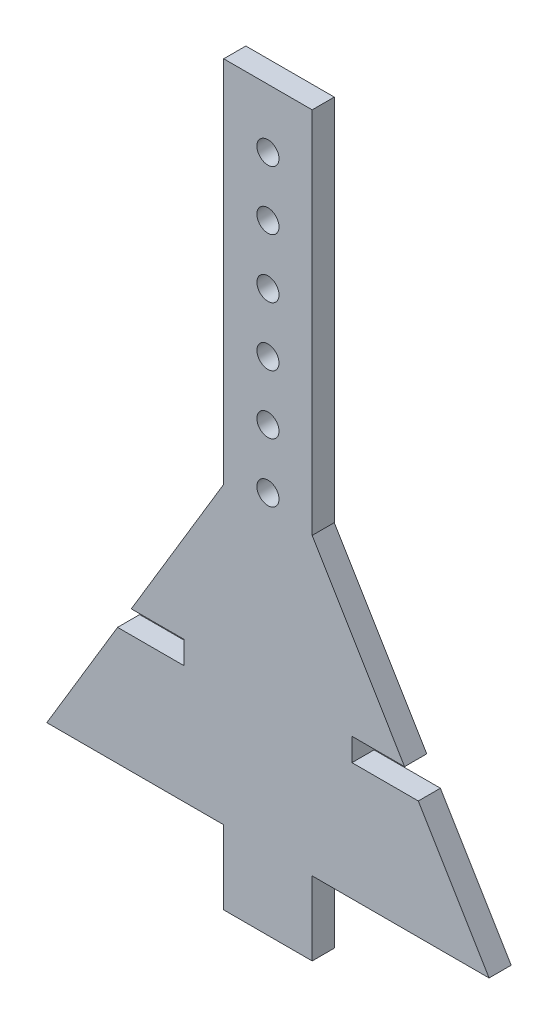
ISO-10303-21;
HEADER;
FILE_DESCRIPTION(('STEP AP214'),'2;1');
FILE_NAME('part.step','',(''),(''),'','','');
FILE_SCHEMA(('AUTOMOTIVE_DESIGN { 1 0 10303 214 1 1 1 1 }'));
ENDSEC;
DATA;
#1=APPLICATION_CONTEXT('core data for automotive mechanical design processes');
#2=APPLICATION_PROTOCOL_DEFINITION('international standard','automotive_design',2000,#1);
#3=PRODUCT_CONTEXT('',#1,'mechanical');
#4=PRODUCT('Part','Part','',(#3));
#5=PRODUCT_RELATED_PRODUCT_CATEGORY('part','',(#4));
#6=PRODUCT_DEFINITION_FORMATION('','',#4);
#7=PRODUCT_DEFINITION_CONTEXT('part definition',#1,'design');
#8=PRODUCT_DEFINITION('design','',#6,#7);
#9=PRODUCT_DEFINITION_SHAPE('','',#8);
#10=(LENGTH_UNIT() NAMED_UNIT(*) SI_UNIT(.MILLI.,.METRE.));
#11=(NAMED_UNIT(*) PLANE_ANGLE_UNIT() SI_UNIT($,.RADIAN.));
#12=(NAMED_UNIT(*) SI_UNIT($,.STERADIAN.) SOLID_ANGLE_UNIT());
#13=UNCERTAINTY_MEASURE_WITH_UNIT(LENGTH_MEASURE(1.E-05),#10,'distance_accuracy_value','');
#14=(GEOMETRIC_REPRESENTATION_CONTEXT(3) GLOBAL_UNCERTAINTY_ASSIGNED_CONTEXT((#13)) GLOBAL_UNIT_ASSIGNED_CONTEXT((#10,
#11,#12)) REPRESENTATION_CONTEXT('',''));
#15=CARTESIAN_POINT('',(0.,0.,0.));
#16=DIRECTION('',(0.,0.,1.));
#17=DIRECTION('',(1.,0.,0.));
#18=AXIS2_PLACEMENT_3D('',#15,#16,#17);
#19=CARTESIAN_POINT('',(0.,0.,15.));
#20=DIRECTION('',(0.,0.,1.));
#21=DIRECTION('',(1.,0.,0.));
#22=AXIS2_PLACEMENT_3D('',#19,#20,#21);
#23=PLANE('',#22);
#24=CARTESIAN_POINT('',(1.66533453693773E-12,50.,15.));
#25=DIRECTION('',(0.,0.,1.));
#26=DIRECTION('',(1.,0.,0.));
#27=AXIS2_PLACEMENT_3D('',#24,#25,#26);
#28=CIRCLE('',#27,7.5);
#29=CARTESIAN_POINT('',(7.50000000000167,50.,15.));
#30=VERTEX_POINT('',#29);
#31=EDGE_CURVE('E217',#30,#30,#28,.T.);
#32=ORIENTED_EDGE('',*,*,#31,.F.);
#33=EDGE_LOOP('',(#32));
#34=FACE_BOUND('',#33,.T.);
#35=CARTESIAN_POINT('',(8.88178419700125E-13,130.,15.));
#36=DIRECTION('',(0.,0.,1.));
#37=DIRECTION('',(1.,0.,0.));
#38=AXIS2_PLACEMENT_3D('',#35,#36,#37);
#39=CIRCLE('',#38,7.5);
#40=CARTESIAN_POINT('',(7.50000000000089,130.,15.));
#41=VERTEX_POINT('',#40);
#42=EDGE_CURVE('E229',#41,#41,#39,.T.);
#43=ORIENTED_EDGE('',*,*,#42,.F.);
#44=EDGE_LOOP('',(#43));
#45=FACE_BOUND('',#44,.T.);
#46=CARTESIAN_POINT('',(0.,210.,15.));
#47=DIRECTION('',(0.,0.,1.));
#48=DIRECTION('',(1.,0.,0.));
#49=AXIS2_PLACEMENT_3D('',#46,#47,#48);
#50=CIRCLE('',#49,7.5);
#51=CARTESIAN_POINT('',(7.5,210.,15.));
#52=VERTEX_POINT('',#51);
#53=EDGE_CURVE('E241',#52,#52,#50,.T.);
#54=ORIENTED_EDGE('',*,*,#53,.F.);
#55=EDGE_LOOP('',(#54));
#56=FACE_BOUND('',#55,.T.);
#57=CARTESIAN_POINT('',(4.44089209850063E-13,170.,15.));
#58=DIRECTION('',(0.,0.,1.));
#59=DIRECTION('',(1.,0.,0.));
#60=AXIS2_PLACEMENT_3D('',#57,#58,#59);
#61=CIRCLE('',#60,7.5);
#62=CARTESIAN_POINT('',(7.50000000000045,170.,15.));
#63=VERTEX_POINT('',#62);
#64=EDGE_CURVE('E235',#63,#63,#61,.T.);
#65=ORIENTED_EDGE('',*,*,#64,.F.);
#66=EDGE_LOOP('',(#65));
#67=FACE_BOUND('',#66,.T.);
#68=CARTESIAN_POINT('',(1.22124532708767E-12,90.,15.));
#69=DIRECTION('',(0.,0.,1.));
#70=DIRECTION('',(1.,0.,0.));
#71=AXIS2_PLACEMENT_3D('',#68,#69,#70);
#72=CIRCLE('',#71,7.5);
#73=CARTESIAN_POINT('',(7.50000000000122,90.,15.));
#74=VERTEX_POINT('',#73);
#75=EDGE_CURVE('E223',#74,#74,#72,.T.);
#76=ORIENTED_EDGE('',*,*,#75,.F.);
#77=EDGE_LOOP('',(#76));
#78=FACE_BOUND('',#77,.T.);
#79=CARTESIAN_POINT('',(2.1094237467878E-12,10.,15.));
#80=DIRECTION('',(0.,0.,1.));
#81=DIRECTION('',(1.,0.,0.));
#82=AXIS2_PLACEMENT_3D('',#79,#80,#81);
#83=CIRCLE('',#82,7.5);
#84=CARTESIAN_POINT('',(7.50000000000211,10.,15.));
#85=VERTEX_POINT('',#84);
#86=EDGE_CURVE('E211',#85,#85,#83,.T.);
#87=ORIENTED_EDGE('',*,*,#86,.F.);
#88=EDGE_LOOP('',(#87));
#89=FACE_BOUND('',#88,.T.);
#90=DIRECTION('',(-0.514495755427527,0.857492925712544,0.));
#91=VECTOR('',#90,1.);
#92=CARTESIAN_POINT('',(30.,0.,15.));
#93=LINE('',#92,#91);
#94=CARTESIAN_POINT('',(150.,-200.,15.));
#95=VERTEX_POINT('',#94);
#96=CARTESIAN_POINT('',(102.,-120.,15.));
#97=VERTEX_POINT('',#96);
#98=EDGE_CURVE('E266',#95,#97,#93,.T.);
#99=ORIENTED_EDGE('',*,*,#98,.T.);
#100=DIRECTION('',(-1.,0.,0.));
#101=VECTOR('',#100,1.);
#102=CARTESIAN_POINT('',(147.989913166257,-120.,15.));
#103=LINE('',#102,#101);
#104=CARTESIAN_POINT('',(57.,-120.,15.));
#105=VERTEX_POINT('',#104);
#106=EDGE_CURVE('E181',#97,#105,#103,.T.);
#107=ORIENTED_EDGE('',*,*,#106,.T.);
#108=DIRECTION('',(0.,1.,0.));
#109=VECTOR('',#108,1.);
#110=CARTESIAN_POINT('',(57.,-104.5,15.));
#111=LINE('',#110,#109);
#112=CARTESIAN_POINT('',(57.,-104.5,15.));
#113=VERTEX_POINT('',#112);
#114=EDGE_CURVE('E184',#105,#113,#111,.T.);
#115=ORIENTED_EDGE('',*,*,#114,.T.);
#116=DIRECTION('',(1.,0.,0.));
#117=VECTOR('',#116,1.);
#118=CARTESIAN_POINT('',(147.989913166257,-104.5,15.));
#119=LINE('',#118,#117);
#120=CARTESIAN_POINT('',(92.7,-104.5,15.));
#121=VERTEX_POINT('',#120);
#122=EDGE_CURVE('E174',#113,#121,#119,.T.);
#123=ORIENTED_EDGE('',*,*,#122,.T.);
#124=CARTESIAN_POINT('',(30.,0.,15.));
#125=VERTEX_POINT('',#124);
#126=EDGE_CURVE('E265',#121,#125,#93,.T.);
#127=ORIENTED_EDGE('',*,*,#126,.T.);
#128=DIRECTION('',(0.,1.,0.));
#129=VECTOR('',#128,1.);
#130=CARTESIAN_POINT('',(30.,0.,15.));
#131=LINE('',#130,#129);
#132=CARTESIAN_POINT('',(30.,250.,15.));
#133=VERTEX_POINT('',#132);
#134=EDGE_CURVE('E269',#125,#133,#131,.T.);
#135=ORIENTED_EDGE('',*,*,#134,.T.);
#136=DIRECTION('',(-1.,0.,0.));
#137=VECTOR('',#136,1.);
#138=CARTESIAN_POINT('',(30.,250.,15.));
#139=LINE('',#138,#137);
#140=CARTESIAN_POINT('',(-30.,250.,15.));
#141=VERTEX_POINT('',#140);
#142=EDGE_CURVE('E271',#133,#141,#139,.T.);
#143=ORIENTED_EDGE('',*,*,#142,.T.);
#144=DIRECTION('',(0.,-1.,0.));
#145=VECTOR('',#144,1.);
#146=CARTESIAN_POINT('',(-30.,0.,15.));
#147=LINE('',#146,#145);
#148=CARTESIAN_POINT('',(-30.,0.,15.));
#149=VERTEX_POINT('',#148);
#150=EDGE_CURVE('E247',#141,#149,#147,.T.);
#151=ORIENTED_EDGE('',*,*,#150,.T.);
#152=DIRECTION('',(-0.514495755427527,-0.857492925712544,0.));
#153=VECTOR('',#152,1.);
#154=CARTESIAN_POINT('',(-30.,0.,15.));
#155=LINE('',#154,#153);
#156=CARTESIAN_POINT('',(-92.7,-104.5,15.));
#157=VERTEX_POINT('',#156);
#158=EDGE_CURVE('E252',#149,#157,#155,.T.);
#159=ORIENTED_EDGE('',*,*,#158,.T.);
#160=DIRECTION('',(-1.,0.,0.));
#161=VECTOR('',#160,1.);
#162=CARTESIAN_POINT('',(-147.989913166257,-104.5,15.));
#163=LINE('',#162,#161);
#164=CARTESIAN_POINT('',(-57.,-104.5,15.));
#165=VERTEX_POINT('',#164);
#166=EDGE_CURVE('E194',#165,#157,#163,.T.);
#167=ORIENTED_EDGE('',*,*,#166,.F.);
#168=DIRECTION('',(0.,1.,0.));
#169=VECTOR('',#168,1.);
#170=CARTESIAN_POINT('',(-57.,-104.5,15.));
#171=LINE('',#170,#169);
#172=CARTESIAN_POINT('',(-57.,-120.,15.));
#173=VERTEX_POINT('',#172);
#174=EDGE_CURVE('E202',#173,#165,#171,.T.);
#175=ORIENTED_EDGE('',*,*,#174,.F.);
#176=DIRECTION('',(1.,0.,0.));
#177=VECTOR('',#176,1.);
#178=CARTESIAN_POINT('',(-147.989913166257,-120.,15.));
#179=LINE('',#178,#177);
#180=CARTESIAN_POINT('',(-102.,-120.,15.));
#181=VERTEX_POINT('',#180);
#182=EDGE_CURVE('E190',#181,#173,#179,.T.);
#183=ORIENTED_EDGE('',*,*,#182,.F.);
#184=CARTESIAN_POINT('',(-150.,-200.,15.));
#185=VERTEX_POINT('',#184);
#186=EDGE_CURVE('E250',#181,#185,#155,.T.);
#187=ORIENTED_EDGE('',*,*,#186,.T.);
#188=DIRECTION('',(1.,0.,0.));
#189=VECTOR('',#188,1.);
#190=CARTESIAN_POINT('',(-150.,-200.,15.));
#191=LINE('',#190,#189);
#192=CARTESIAN_POINT('',(-30.,-200.,15.));
#193=VERTEX_POINT('',#192);
#194=EDGE_CURVE('E255',#185,#193,#191,.T.);
#195=ORIENTED_EDGE('',*,*,#194,.T.);
#196=DIRECTION('',(0.,-1.,0.));
#197=VECTOR('',#196,1.);
#198=CARTESIAN_POINT('',(-30.,-250.,15.));
#199=LINE('',#198,#197);
#200=CARTESIAN_POINT('',(-30.,-250.,15.));
#201=VERTEX_POINT('',#200);
#202=EDGE_CURVE('E257',#193,#201,#199,.T.);
#203=ORIENTED_EDGE('',*,*,#202,.T.);
#204=DIRECTION('',(1.,0.,0.));
#205=VECTOR('',#204,1.);
#206=CARTESIAN_POINT('',(30.,-250.,15.));
#207=LINE('',#206,#205);
#208=CARTESIAN_POINT('',(30.,-250.,15.));
#209=VERTEX_POINT('',#208);
#210=EDGE_CURVE('E259',#201,#209,#207,.T.);
#211=ORIENTED_EDGE('',*,*,#210,.T.);
#212=DIRECTION('',(0.,1.,0.));
#213=VECTOR('',#212,1.);
#214=CARTESIAN_POINT('',(30.,-250.,15.));
#215=LINE('',#214,#213);
#216=CARTESIAN_POINT('',(30.,-200.,15.));
#217=VERTEX_POINT('',#216);
#218=EDGE_CURVE('E261',#209,#217,#215,.T.);
#219=ORIENTED_EDGE('',*,*,#218,.T.);
#220=DIRECTION('',(1.,0.,0.));
#221=VECTOR('',#220,1.);
#222=CARTESIAN_POINT('',(150.,-200.,15.));
#223=LINE('',#222,#221);
#224=EDGE_CURVE('E263',#217,#95,#223,.T.);
#225=ORIENTED_EDGE('',*,*,#224,.T.);
#226=EDGE_LOOP('',(#99,#107,#115,#123,#127,#135,#143,#151,#159,#167,#175,#183,#187,#195,#203,
#211,#219,#225));
#227=FACE_BOUND('',#226,.T.);
#228=ADVANCED_FACE('F37',(#34,#45,#56,#67,#78,#89,#227),#23,.T.);
#229=CARTESIAN_POINT('',(0.,0.,0.));
#230=DIRECTION('',(0.,0.,1.));
#231=DIRECTION('',(1.,0.,0.));
#232=AXIS2_PLACEMENT_3D('',#229,#230,#231);
#233=PLANE('',#232);
#234=CARTESIAN_POINT('',(2.1094237467878E-12,10.,0.));
#235=DIRECTION('',(0.,0.,1.));
#236=DIRECTION('',(1.,0.,0.));
#237=AXIS2_PLACEMENT_3D('',#234,#235,#236);
#238=CIRCLE('',#237,7.5);
#239=CARTESIAN_POINT('',(7.50000000000211,10.,0.));
#240=VERTEX_POINT('',#239);
#241=EDGE_CURVE('E208',#240,#240,#238,.T.);
#242=ORIENTED_EDGE('',*,*,#241,.T.);
#243=EDGE_LOOP('',(#242));
#244=FACE_BOUND('',#243,.T.);
#245=CARTESIAN_POINT('',(1.66533453693773E-12,50.,0.));
#246=DIRECTION('',(0.,0.,1.));
#247=DIRECTION('',(1.,0.,0.));
#248=AXIS2_PLACEMENT_3D('',#245,#246,#247);
#249=CIRCLE('',#248,7.5);
#250=CARTESIAN_POINT('',(7.50000000000167,50.,0.));
#251=VERTEX_POINT('',#250);
#252=EDGE_CURVE('E214',#251,#251,#249,.T.);
#253=ORIENTED_EDGE('',*,*,#252,.T.);
#254=EDGE_LOOP('',(#253));
#255=FACE_BOUND('',#254,.T.);
#256=CARTESIAN_POINT('',(1.22124532708767E-12,90.,0.));
#257=DIRECTION('',(0.,0.,1.));
#258=DIRECTION('',(1.,0.,0.));
#259=AXIS2_PLACEMENT_3D('',#256,#257,#258);
#260=CIRCLE('',#259,7.5);
#261=CARTESIAN_POINT('',(7.50000000000122,90.,0.));
#262=VERTEX_POINT('',#261);
#263=EDGE_CURVE('E220',#262,#262,#260,.T.);
#264=ORIENTED_EDGE('',*,*,#263,.T.);
#265=EDGE_LOOP('',(#264));
#266=FACE_BOUND('',#265,.T.);
#267=CARTESIAN_POINT('',(8.88178419700125E-13,130.,0.));
#268=DIRECTION('',(0.,0.,1.));
#269=DIRECTION('',(1.,0.,0.));
#270=AXIS2_PLACEMENT_3D('',#267,#268,#269);
#271=CIRCLE('',#270,7.5);
#272=CARTESIAN_POINT('',(7.50000000000089,130.,0.));
#273=VERTEX_POINT('',#272);
#274=EDGE_CURVE('E226',#273,#273,#271,.T.);
#275=ORIENTED_EDGE('',*,*,#274,.T.);
#276=EDGE_LOOP('',(#275));
#277=FACE_BOUND('',#276,.T.);
#278=CARTESIAN_POINT('',(4.44089209850063E-13,170.,0.));
#279=DIRECTION('',(0.,0.,1.));
#280=DIRECTION('',(1.,0.,0.));
#281=AXIS2_PLACEMENT_3D('',#278,#279,#280);
#282=CIRCLE('',#281,7.5);
#283=CARTESIAN_POINT('',(7.50000000000045,170.,0.));
#284=VERTEX_POINT('',#283);
#285=EDGE_CURVE('E232',#284,#284,#282,.T.);
#286=ORIENTED_EDGE('',*,*,#285,.T.);
#287=EDGE_LOOP('',(#286));
#288=FACE_BOUND('',#287,.T.);
#289=CARTESIAN_POINT('',(0.,210.,0.));
#290=DIRECTION('',(0.,0.,1.));
#291=DIRECTION('',(1.,0.,0.));
#292=AXIS2_PLACEMENT_3D('',#289,#290,#291);
#293=CIRCLE('',#292,7.5);
#294=CARTESIAN_POINT('',(7.5,210.,0.));
#295=VERTEX_POINT('',#294);
#296=EDGE_CURVE('E238',#295,#295,#293,.T.);
#297=ORIENTED_EDGE('',*,*,#296,.T.);
#298=EDGE_LOOP('',(#297));
#299=FACE_BOUND('',#298,.T.);
#300=DIRECTION('',(-1.,0.,0.));
#301=VECTOR('',#300,1.);
#302=CARTESIAN_POINT('',(147.989913166257,-120.,0.));
#303=LINE('',#302,#301);
#304=CARTESIAN_POINT('',(102.,-120.,0.));
#305=VERTEX_POINT('',#304);
#306=CARTESIAN_POINT('',(57.,-120.,0.));
#307=VERTEX_POINT('',#306);
#308=EDGE_CURVE('E170',#305,#307,#303,.T.);
#309=ORIENTED_EDGE('',*,*,#308,.F.);
#310=DIRECTION('',(-0.514495755427527,0.857492925712544,0.));
#311=VECTOR('',#310,1.);
#312=CARTESIAN_POINT('',(30.,0.,0.));
#313=LINE('',#312,#311);
#314=CARTESIAN_POINT('',(150.,-200.,0.));
#315=VERTEX_POINT('',#314);
#316=EDGE_CURVE('E290',#315,#305,#313,.T.);
#317=ORIENTED_EDGE('',*,*,#316,.F.);
#318=DIRECTION('',(1.,0.,0.));
#319=VECTOR('',#318,1.);
#320=CARTESIAN_POINT('',(150.,-200.,0.));
#321=LINE('',#320,#319);
#322=CARTESIAN_POINT('',(30.,-200.,0.));
#323=VERTEX_POINT('',#322);
#324=EDGE_CURVE('E288',#323,#315,#321,.T.);
#325=ORIENTED_EDGE('',*,*,#324,.F.);
#326=DIRECTION('',(0.,1.,0.));
#327=VECTOR('',#326,1.);
#328=CARTESIAN_POINT('',(30.,-250.,0.));
#329=LINE('',#328,#327);
#330=CARTESIAN_POINT('',(30.,-250.,0.));
#331=VERTEX_POINT('',#330);
#332=EDGE_CURVE('E286',#331,#323,#329,.T.);
#333=ORIENTED_EDGE('',*,*,#332,.F.);
#334=DIRECTION('',(1.,0.,0.));
#335=VECTOR('',#334,1.);
#336=CARTESIAN_POINT('',(30.,-250.,0.));
#337=LINE('',#336,#335);
#338=CARTESIAN_POINT('',(-30.,-250.,0.));
#339=VERTEX_POINT('',#338);
#340=EDGE_CURVE('E284',#339,#331,#337,.T.);
#341=ORIENTED_EDGE('',*,*,#340,.F.);
#342=DIRECTION('',(0.,-1.,0.));
#343=VECTOR('',#342,1.);
#344=CARTESIAN_POINT('',(-30.,-250.,0.));
#345=LINE('',#344,#343);
#346=CARTESIAN_POINT('',(-30.,-200.,0.));
#347=VERTEX_POINT('',#346);
#348=EDGE_CURVE('E282',#347,#339,#345,.T.);
#349=ORIENTED_EDGE('',*,*,#348,.F.);
#350=DIRECTION('',(1.,0.,0.));
#351=VECTOR('',#350,1.);
#352=CARTESIAN_POINT('',(-150.,-200.,0.));
#353=LINE('',#352,#351);
#354=CARTESIAN_POINT('',(-150.,-200.,0.));
#355=VERTEX_POINT('',#354);
#356=EDGE_CURVE('E280',#355,#347,#353,.T.);
#357=ORIENTED_EDGE('',*,*,#356,.F.);
#358=DIRECTION('',(-0.514495755427527,-0.857492925712544,0.));
#359=VECTOR('',#358,1.);
#360=CARTESIAN_POINT('',(-30.,0.,0.));
#361=LINE('',#360,#359);
#362=CARTESIAN_POINT('',(-102.,-120.,0.));
#363=VERTEX_POINT('',#362);
#364=EDGE_CURVE('E276',#363,#355,#361,.T.);
#365=ORIENTED_EDGE('',*,*,#364,.F.);
#366=DIRECTION('',(1.,0.,0.));
#367=VECTOR('',#366,1.);
#368=CARTESIAN_POINT('',(-147.989913166257,-120.,0.));
#369=LINE('',#368,#367);
#370=CARTESIAN_POINT('',(-57.,-120.,0.));
#371=VERTEX_POINT('',#370);
#372=EDGE_CURVE('E60',#363,#371,#369,.T.);
#373=ORIENTED_EDGE('',*,*,#372,.T.);
#374=DIRECTION('',(0.,1.,0.));
#375=VECTOR('',#374,1.);
#376=CARTESIAN_POINT('',(-57.,-104.5,0.));
#377=LINE('',#376,#375);
#378=CARTESIAN_POINT('',(-57.,-104.5,0.));
#379=VERTEX_POINT('',#378);
#380=EDGE_CURVE('E193',#371,#379,#377,.T.);
#381=ORIENTED_EDGE('',*,*,#380,.T.);
#382=DIRECTION('',(-1.,0.,0.));
#383=VECTOR('',#382,1.);
#384=CARTESIAN_POINT('',(-147.989913166257,-104.5,0.));
#385=LINE('',#384,#383);
#386=CARTESIAN_POINT('',(-92.7,-104.5,0.));
#387=VERTEX_POINT('',#386);
#388=EDGE_CURVE('E197',#379,#387,#385,.T.);
#389=ORIENTED_EDGE('',*,*,#388,.T.);
#390=CARTESIAN_POINT('',(-30.,0.,0.));
#391=VERTEX_POINT('',#390);
#392=EDGE_CURVE('E277',#391,#387,#361,.T.);
#393=ORIENTED_EDGE('',*,*,#392,.F.);
#394=DIRECTION('',(0.,-1.,0.));
#395=VECTOR('',#394,1.);
#396=CARTESIAN_POINT('',(-30.,0.,0.));
#397=LINE('',#396,#395);
#398=CARTESIAN_POINT('',(-30.,250.,0.));
#399=VERTEX_POINT('',#398);
#400=EDGE_CURVE('E244',#399,#391,#397,.T.);
#401=ORIENTED_EDGE('',*,*,#400,.F.);
#402=DIRECTION('',(-1.,0.,0.));
#403=VECTOR('',#402,1.);
#404=CARTESIAN_POINT('',(30.,250.,0.));
#405=LINE('',#404,#403);
#406=CARTESIAN_POINT('',(30.,250.,0.));
#407=VERTEX_POINT('',#406);
#408=EDGE_CURVE('E251',#407,#399,#405,.T.);
#409=ORIENTED_EDGE('',*,*,#408,.F.);
#410=DIRECTION('',(0.,1.,0.));
#411=VECTOR('',#410,1.);
#412=CARTESIAN_POINT('',(30.,0.,0.));
#413=LINE('',#412,#411);
#414=CARTESIAN_POINT('',(30.,0.,0.));
#415=VERTEX_POINT('',#414);
#416=EDGE_CURVE('E293',#415,#407,#413,.T.);
#417=ORIENTED_EDGE('',*,*,#416,.F.);
#418=CARTESIAN_POINT('',(92.7,-104.5,0.));
#419=VERTEX_POINT('',#418);
#420=EDGE_CURVE('E180',#419,#415,#313,.T.);
#421=ORIENTED_EDGE('',*,*,#420,.F.);
#422=DIRECTION('',(1.,0.,0.));
#423=VECTOR('',#422,1.);
#424=CARTESIAN_POINT('',(147.989913166257,-104.5,0.));
#425=LINE('',#424,#423);
#426=CARTESIAN_POINT('',(57.,-104.5,0.));
#427=VERTEX_POINT('',#426);
#428=EDGE_CURVE('E52',#427,#419,#425,.T.);
#429=ORIENTED_EDGE('',*,*,#428,.F.);
#430=DIRECTION('',(0.,1.,0.));
#431=VECTOR('',#430,1.);
#432=CARTESIAN_POINT('',(57.,-104.5,0.));
#433=LINE('',#432,#431);
#434=EDGE_CURVE('E162',#307,#427,#433,.T.);
#435=ORIENTED_EDGE('',*,*,#434,.F.);
#436=EDGE_LOOP('',(#309,#317,#325,#333,#341,#349,#357,#365,#373,#381,#389,#393,#401,#409,#417,
#421,#429,#435));
#437=FACE_BOUND('',#436,.T.);
#438=ADVANCED_FACE('F178',(#244,#255,#266,#277,#288,#299,#437),#233,.F.);
#439=CARTESIAN_POINT('',(30.,0.,15.));
#440=DIRECTION('',(-0.857492925712544,-0.514495755427527,0.));
#441=DIRECTION('',(0.514495755427527,-0.857492925712544,0.));
#442=AXIS2_PLACEMENT_3D('',#439,#440,#441);
#443=PLANE('',#442);
#444=DIRECTION('',(0.,0.,-1.));
#445=VECTOR('',#444,1.);
#446=CARTESIAN_POINT('',(102.,-120.,15.));
#447=LINE('',#446,#445);
#448=EDGE_CURVE('E11',#97,#305,#447,.T.);
#449=ORIENTED_EDGE('',*,*,#448,.F.);
#450=ORIENTED_EDGE('',*,*,#98,.F.);
#451=DIRECTION('',(0.,0.,-1.));
#452=VECTOR('',#451,1.);
#453=CARTESIAN_POINT('',(150.,-200.,15.));
#454=LINE('',#453,#452);
#455=EDGE_CURVE('E304',#95,#315,#454,.T.);
#456=ORIENTED_EDGE('',*,*,#455,.T.);
#457=ORIENTED_EDGE('',*,*,#316,.T.);
#458=EDGE_LOOP('',(#449,#450,#456,#457));
#459=FACE_BOUND('',#458,.T.);
#460=ADVANCED_FACE('F393',(#459),#443,.F.);
#461=DIRECTION('',(0.,0.,1.));
#462=VECTOR('',#461,1.);
#463=CARTESIAN_POINT('',(92.7,-104.5,15.));
#464=LINE('',#463,#462);
#465=EDGE_CURVE('E45',#419,#121,#464,.T.);
#466=ORIENTED_EDGE('',*,*,#465,.F.);
#467=ORIENTED_EDGE('',*,*,#420,.T.);
#468=DIRECTION('',(0.,0.,-1.));
#469=VECTOR('',#468,1.);
#470=CARTESIAN_POINT('',(30.,0.,15.));
#471=LINE('',#470,#469);
#472=EDGE_CURVE('E301',#125,#415,#471,.T.);
#473=ORIENTED_EDGE('',*,*,#472,.F.);
#474=ORIENTED_EDGE('',*,*,#126,.F.);
#475=EDGE_LOOP('',(#466,#467,#473,#474));
#476=FACE_BOUND('',#475,.T.);
#477=ADVANCED_FACE('F333',(#476),#443,.F.);
#478=CARTESIAN_POINT('',(-30.,0.,15.));
#479=DIRECTION('',(0.857492925712544,-0.514495755427527,0.));
#480=DIRECTION('',(0.514495755427527,0.857492925712544,0.));
#481=AXIS2_PLACEMENT_3D('',#478,#479,#480);
#482=PLANE('',#481);
#483=ORIENTED_EDGE('',*,*,#392,.T.);
#484=DIRECTION('',(0.,0.,1.));
#485=VECTOR('',#484,1.);
#486=CARTESIAN_POINT('',(-92.7,-104.5,15.));
#487=LINE('',#486,#485);
#488=EDGE_CURVE('E327',#387,#157,#487,.T.);
#489=ORIENTED_EDGE('',*,*,#488,.T.);
#490=ORIENTED_EDGE('',*,*,#158,.F.);
#491=DIRECTION('',(0.,0.,-1.));
#492=VECTOR('',#491,1.);
#493=CARTESIAN_POINT('',(-30.,0.,15.));
#494=LINE('',#493,#492);
#495=EDGE_CURVE('E322',#149,#391,#494,.T.);
#496=ORIENTED_EDGE('',*,*,#495,.T.);
#497=EDGE_LOOP('',(#483,#489,#490,#496));
#498=FACE_BOUND('',#497,.T.);
#499=ADVANCED_FACE('F348',(#498),#482,.F.);
#500=CARTESIAN_POINT('',(-30.,0.,15.));
#501=DIRECTION('',(1.,0.,0.));
#502=DIRECTION('',(0.,0.,-1.));
#503=AXIS2_PLACEMENT_3D('',#500,#501,#502);
#504=PLANE('',#503);
#505=ORIENTED_EDGE('',*,*,#400,.T.);
#506=ORIENTED_EDGE('',*,*,#495,.F.);
#507=ORIENTED_EDGE('',*,*,#150,.F.);
#508=DIRECTION('',(0.,0.,-1.));
#509=VECTOR('',#508,1.);
#510=CARTESIAN_POINT('',(-30.,250.,15.));
#511=LINE('',#510,#509);
#512=EDGE_CURVE('E273',#141,#399,#511,.T.);
#513=ORIENTED_EDGE('',*,*,#512,.T.);
#514=EDGE_LOOP('',(#505,#506,#507,#513));
#515=FACE_BOUND('',#514,.T.);
#516=ADVANCED_FACE('F39',(#515),#504,.F.);
#517=ORIENTED_EDGE('',*,*,#186,.F.);
#518=DIRECTION('',(0.,0.,-1.));
#519=VECTOR('',#518,1.);
#520=CARTESIAN_POINT('',(-102.,-120.,15.));
#521=LINE('',#520,#519);
#522=EDGE_CURVE('E325',#181,#363,#521,.T.);
#523=ORIENTED_EDGE('',*,*,#522,.T.);
#524=ORIENTED_EDGE('',*,*,#364,.T.);
#525=DIRECTION('',(0.,0.,-1.));
#526=VECTOR('',#525,1.);
#527=CARTESIAN_POINT('',(-150.,-200.,15.));
#528=LINE('',#527,#526);
#529=EDGE_CURVE('E319',#185,#355,#528,.T.);
#530=ORIENTED_EDGE('',*,*,#529,.F.);
#531=EDGE_LOOP('',(#517,#523,#524,#530));
#532=FACE_BOUND('',#531,.T.);
#533=ADVANCED_FACE('F362',(#532),#482,.F.);
#534=CARTESIAN_POINT('',(-150.,-200.,15.));
#535=DIRECTION('',(0.,1.,0.));
#536=DIRECTION('',(-1.,0.,0.));
#537=AXIS2_PLACEMENT_3D('',#534,#535,#536);
#538=PLANE('',#537);
#539=ORIENTED_EDGE('',*,*,#356,.T.);
#540=DIRECTION('',(0.,0.,-1.));
#541=VECTOR('',#540,1.);
#542=CARTESIAN_POINT('',(-30.,-200.,15.));
#543=LINE('',#542,#541);
#544=EDGE_CURVE('E316',#193,#347,#543,.T.);
#545=ORIENTED_EDGE('',*,*,#544,.F.);
#546=ORIENTED_EDGE('',*,*,#194,.F.);
#547=ORIENTED_EDGE('',*,*,#529,.T.);
#548=EDGE_LOOP('',(#539,#545,#546,#547));
#549=FACE_BOUND('',#548,.T.);
#550=ADVANCED_FACE('F368',(#549),#538,.F.);
#551=CARTESIAN_POINT('',(-30.,-250.,15.));
#552=DIRECTION('',(1.,0.,0.));
#553=DIRECTION('',(0.,0.,-1.));
#554=AXIS2_PLACEMENT_3D('',#551,#552,#553);
#555=PLANE('',#554);
#556=ORIENTED_EDGE('',*,*,#348,.T.);
#557=DIRECTION('',(0.,0.,-1.));
#558=VECTOR('',#557,1.);
#559=CARTESIAN_POINT('',(-30.,-250.,15.));
#560=LINE('',#559,#558);
#561=EDGE_CURVE('E313',#201,#339,#560,.T.);
#562=ORIENTED_EDGE('',*,*,#561,.F.);
#563=ORIENTED_EDGE('',*,*,#202,.F.);
#564=ORIENTED_EDGE('',*,*,#544,.T.);
#565=EDGE_LOOP('',(#556,#562,#563,#564));
#566=FACE_BOUND('',#565,.T.);
#567=ADVANCED_FACE('F374',(#566),#555,.F.);
#568=CARTESIAN_POINT('',(30.,-250.,15.));
#569=DIRECTION('',(0.,1.,0.));
#570=DIRECTION('',(0.,0.,1.));
#571=AXIS2_PLACEMENT_3D('',#568,#569,#570);
#572=PLANE('',#571);
#573=ORIENTED_EDGE('',*,*,#340,.T.);
#574=DIRECTION('',(0.,0.,-1.));
#575=VECTOR('',#574,1.);
#576=CARTESIAN_POINT('',(30.,-250.,15.));
#577=LINE('',#576,#575);
#578=EDGE_CURVE('E310',#209,#331,#577,.T.);
#579=ORIENTED_EDGE('',*,*,#578,.F.);
#580=ORIENTED_EDGE('',*,*,#210,.F.);
#581=ORIENTED_EDGE('',*,*,#561,.T.);
#582=EDGE_LOOP('',(#573,#579,#580,#581));
#583=FACE_BOUND('',#582,.T.);
#584=ADVANCED_FACE('F378',(#583),#572,.F.);
#585=CARTESIAN_POINT('',(30.,-250.,15.));
#586=DIRECTION('',(-1.,0.,0.));
#587=DIRECTION('',(0.,-1.,0.));
#588=AXIS2_PLACEMENT_3D('',#585,#586,#587);
#589=PLANE('',#588);
#590=ORIENTED_EDGE('',*,*,#332,.T.);
#591=DIRECTION('',(0.,0.,-1.));
#592=VECTOR('',#591,1.);
#593=CARTESIAN_POINT('',(30.,-200.,15.));
#594=LINE('',#593,#592);
#595=EDGE_CURVE('E307',#217,#323,#594,.T.);
#596=ORIENTED_EDGE('',*,*,#595,.F.);
#597=ORIENTED_EDGE('',*,*,#218,.F.);
#598=ORIENTED_EDGE('',*,*,#578,.T.);
#599=EDGE_LOOP('',(#590,#596,#597,#598));
#600=FACE_BOUND('',#599,.T.);
#601=ADVANCED_FACE('F383',(#600),#589,.F.);
#602=CARTESIAN_POINT('',(150.,-200.,15.));
#603=DIRECTION('',(0.,1.,0.));
#604=DIRECTION('',(-1.,0.,0.));
#605=AXIS2_PLACEMENT_3D('',#602,#603,#604);
#606=PLANE('',#605);
#607=ORIENTED_EDGE('',*,*,#324,.T.);
#608=ORIENTED_EDGE('',*,*,#455,.F.);
#609=ORIENTED_EDGE('',*,*,#224,.F.);
#610=ORIENTED_EDGE('',*,*,#595,.T.);
#611=EDGE_LOOP('',(#607,#608,#609,#610));
#612=FACE_BOUND('',#611,.T.);
#613=ADVANCED_FACE('F388',(#612),#606,.F.);
#614=CARTESIAN_POINT('',(30.,0.,15.));
#615=DIRECTION('',(-1.,0.,0.));
#616=DIRECTION('',(0.,-1.,0.));
#617=AXIS2_PLACEMENT_3D('',#614,#615,#616);
#618=PLANE('',#617);
#619=ORIENTED_EDGE('',*,*,#416,.T.);
#620=DIRECTION('',(0.,0.,-1.));
#621=VECTOR('',#620,1.);
#622=CARTESIAN_POINT('',(30.,250.,15.));
#623=LINE('',#622,#621);
#624=EDGE_CURVE('E298',#133,#407,#623,.T.);
#625=ORIENTED_EDGE('',*,*,#624,.F.);
#626=ORIENTED_EDGE('',*,*,#134,.F.);
#627=ORIENTED_EDGE('',*,*,#472,.T.);
#628=EDGE_LOOP('',(#619,#625,#626,#627));
#629=FACE_BOUND('',#628,.T.);
#630=ADVANCED_FACE('F337',(#629),#618,.F.);
#631=CARTESIAN_POINT('',(30.,250.,15.));
#632=DIRECTION('',(0.,-1.,0.));
#633=DIRECTION('',(0.,0.,-1.));
#634=AXIS2_PLACEMENT_3D('',#631,#632,#633);
#635=PLANE('',#634);
#636=ORIENTED_EDGE('',*,*,#408,.T.);
#637=ORIENTED_EDGE('',*,*,#512,.F.);
#638=ORIENTED_EDGE('',*,*,#142,.F.);
#639=ORIENTED_EDGE('',*,*,#624,.T.);
#640=EDGE_LOOP('',(#636,#637,#638,#639));
#641=FACE_BOUND('',#640,.T.);
#642=ADVANCED_FACE('F343',(#641),#635,.F.);
#643=CARTESIAN_POINT('',(0.,210.,15.));
#644=DIRECTION('',(0.,0.,-1.));
#645=DIRECTION('',(-1.,0.,0.));
#646=AXIS2_PLACEMENT_3D('',#643,#644,#645);
#647=CYLINDRICAL_SURFACE('',#646,7.5);
#648=ORIENTED_EDGE('',*,*,#53,.T.);
#649=EDGE_LOOP('',(#648));
#650=FACE_BOUND('',#649,.T.);
#651=ORIENTED_EDGE('',*,*,#296,.F.);
#652=EDGE_LOOP('',(#651));
#653=FACE_BOUND('',#652,.T.);
#654=ADVANCED_FACE('F416',(#650,#653),#647,.F.);
#655=CARTESIAN_POINT('',(4.44089209850063E-13,170.,15.));
#656=DIRECTION('',(0.,0.,-1.));
#657=DIRECTION('',(-1.,0.,0.));
#658=AXIS2_PLACEMENT_3D('',#655,#656,#657);
#659=CYLINDRICAL_SURFACE('',#658,7.5);
#660=ORIENTED_EDGE('',*,*,#64,.T.);
#661=EDGE_LOOP('',(#660));
#662=FACE_BOUND('',#661,.T.);
#663=ORIENTED_EDGE('',*,*,#285,.F.);
#664=EDGE_LOOP('',(#663));
#665=FACE_BOUND('',#664,.T.);
#666=ADVANCED_FACE('F497',(#662,#665),#659,.F.);
#667=CARTESIAN_POINT('',(8.88178419700125E-13,130.,15.));
#668=DIRECTION('',(0.,0.,-1.));
#669=DIRECTION('',(-1.,0.,0.));
#670=AXIS2_PLACEMENT_3D('',#667,#668,#669);
#671=CYLINDRICAL_SURFACE('',#670,7.5);
#672=ORIENTED_EDGE('',*,*,#42,.T.);
#673=EDGE_LOOP('',(#672));
#674=FACE_BOUND('',#673,.T.);
#675=ORIENTED_EDGE('',*,*,#274,.F.);
#676=EDGE_LOOP('',(#675));
#677=FACE_BOUND('',#676,.T.);
#678=ADVANCED_FACE('F494',(#674,#677),#671,.F.);
#679=CARTESIAN_POINT('',(1.22124532708767E-12,90.,15.));
#680=DIRECTION('',(0.,0.,-1.));
#681=DIRECTION('',(-1.,0.,0.));
#682=AXIS2_PLACEMENT_3D('',#679,#680,#681);
#683=CYLINDRICAL_SURFACE('',#682,7.5);
#684=ORIENTED_EDGE('',*,*,#75,.T.);
#685=EDGE_LOOP('',(#684));
#686=FACE_BOUND('',#685,.T.);
#687=ORIENTED_EDGE('',*,*,#263,.F.);
#688=EDGE_LOOP('',(#687));
#689=FACE_BOUND('',#688,.T.);
#690=ADVANCED_FACE('F490',(#686,#689),#683,.F.);
#691=CARTESIAN_POINT('',(1.66533453693773E-12,50.,15.));
#692=DIRECTION('',(0.,0.,-1.));
#693=DIRECTION('',(-1.,0.,0.));
#694=AXIS2_PLACEMENT_3D('',#691,#692,#693);
#695=CYLINDRICAL_SURFACE('',#694,7.5);
#696=ORIENTED_EDGE('',*,*,#31,.T.);
#697=EDGE_LOOP('',(#696));
#698=FACE_BOUND('',#697,.T.);
#699=ORIENTED_EDGE('',*,*,#252,.F.);
#700=EDGE_LOOP('',(#699));
#701=FACE_BOUND('',#700,.T.);
#702=ADVANCED_FACE('F486',(#698,#701),#695,.F.);
#703=CARTESIAN_POINT('',(2.1094237467878E-12,10.,15.));
#704=DIRECTION('',(0.,0.,-1.));
#705=DIRECTION('',(-1.,0.,0.));
#706=AXIS2_PLACEMENT_3D('',#703,#704,#705);
#707=CYLINDRICAL_SURFACE('',#706,7.5);
#708=ORIENTED_EDGE('',*,*,#86,.T.);
#709=EDGE_LOOP('',(#708));
#710=FACE_BOUND('',#709,.T.);
#711=ORIENTED_EDGE('',*,*,#241,.F.);
#712=EDGE_LOOP('',(#711));
#713=FACE_BOUND('',#712,.T.);
#714=ADVANCED_FACE('F480',(#710,#713),#707,.F.);
#715=CARTESIAN_POINT('',(-147.989913166257,-104.5,0.));
#716=DIRECTION('',(0.,1.,0.));
#717=DIRECTION('',(0.,0.,1.));
#718=AXIS2_PLACEMENT_3D('',#715,#716,#717);
#719=PLANE('',#718);
#720=ORIENTED_EDGE('',*,*,#388,.F.);
#721=DIRECTION('',(0.,0.,1.));
#722=VECTOR('',#721,1.);
#723=CARTESIAN_POINT('',(-57.,-104.5,0.));
#724=LINE('',#723,#722);
#725=EDGE_CURVE('E206',#379,#165,#724,.T.);
#726=ORIENTED_EDGE('',*,*,#725,.T.);
#727=ORIENTED_EDGE('',*,*,#166,.T.);
#728=ORIENTED_EDGE('',*,*,#488,.F.);
#729=EDGE_LOOP('',(#720,#726,#727,#728));
#730=FACE_BOUND('',#729,.T.);
#731=ADVANCED_FACE('F354',(#730),#719,.F.);
#732=CARTESIAN_POINT('',(-147.989913166257,-120.,0.));
#733=DIRECTION('',(0.,-1.,0.));
#734=DIRECTION('',(0.,0.,-1.));
#735=AXIS2_PLACEMENT_3D('',#732,#733,#734);
#736=PLANE('',#735);
#737=ORIENTED_EDGE('',*,*,#182,.T.);
#738=DIRECTION('',(0.,0.,1.));
#739=VECTOR('',#738,1.);
#740=CARTESIAN_POINT('',(-57.,-120.,0.));
#741=LINE('',#740,#739);
#742=EDGE_CURVE('E200',#371,#173,#741,.T.);
#743=ORIENTED_EDGE('',*,*,#742,.F.);
#744=ORIENTED_EDGE('',*,*,#372,.F.);
#745=ORIENTED_EDGE('',*,*,#522,.F.);
#746=EDGE_LOOP('',(#737,#743,#744,#745));
#747=FACE_BOUND('',#746,.T.);
#748=ADVANCED_FACE('F358',(#747),#736,.F.);
#749=CARTESIAN_POINT('',(-57.,-104.5,0.));
#750=DIRECTION('',(1.,0.,0.));
#751=DIRECTION('',(0.,0.,-1.));
#752=AXIS2_PLACEMENT_3D('',#749,#750,#751);
#753=PLANE('',#752);
#754=ORIENTED_EDGE('',*,*,#174,.T.);
#755=ORIENTED_EDGE('',*,*,#725,.F.);
#756=ORIENTED_EDGE('',*,*,#380,.F.);
#757=ORIENTED_EDGE('',*,*,#742,.T.);
#758=EDGE_LOOP('',(#754,#755,#756,#757));
#759=FACE_BOUND('',#758,.T.);
#760=ADVANCED_FACE('F357',(#759),#753,.F.);
#761=CARTESIAN_POINT('',(147.989913166257,-120.,0.));
#762=DIRECTION('',(0.,1.,0.));
#763=DIRECTION('',(0.,0.,1.));
#764=AXIS2_PLACEMENT_3D('',#761,#762,#763);
#765=PLANE('',#764);
#766=ORIENTED_EDGE('',*,*,#448,.T.);
#767=ORIENTED_EDGE('',*,*,#308,.T.);
#768=DIRECTION('',(0.,0.,1.));
#769=VECTOR('',#768,1.);
#770=CARTESIAN_POINT('',(57.,-120.,0.));
#771=LINE('',#770,#769);
#772=EDGE_CURVE('E167',#307,#105,#771,.T.);
#773=ORIENTED_EDGE('',*,*,#772,.T.);
#774=ORIENTED_EDGE('',*,*,#106,.F.);
#775=EDGE_LOOP('',(#766,#767,#773,#774));
#776=FACE_BOUND('',#775,.T.);
#777=ADVANCED_FACE('F395',(#776),#765,.T.);
#778=CARTESIAN_POINT('',(147.989913166257,-104.5,0.));
#779=DIRECTION('',(0.,-1.,0.));
#780=DIRECTION('',(0.,0.,-1.));
#781=AXIS2_PLACEMENT_3D('',#778,#779,#780);
#782=PLANE('',#781);
#783=ORIENTED_EDGE('',*,*,#465,.T.);
#784=ORIENTED_EDGE('',*,*,#122,.F.);
#785=DIRECTION('',(0.,0.,1.));
#786=VECTOR('',#785,1.);
#787=CARTESIAN_POINT('',(57.,-104.5,0.));
#788=LINE('',#787,#786);
#789=EDGE_CURVE('E165',#427,#113,#788,.T.);
#790=ORIENTED_EDGE('',*,*,#789,.F.);
#791=ORIENTED_EDGE('',*,*,#428,.T.);
#792=EDGE_LOOP('',(#783,#784,#790,#791));
#793=FACE_BOUND('',#792,.T.);
#794=ADVANCED_FACE('F172',(#793),#782,.T.);
#795=CARTESIAN_POINT('',(57.,-104.5,0.));
#796=DIRECTION('',(1.,0.,0.));
#797=DIRECTION('',(0.,0.,-1.));
#798=AXIS2_PLACEMENT_3D('',#795,#796,#797);
#799=PLANE('',#798);
#800=ORIENTED_EDGE('',*,*,#114,.F.);
#801=ORIENTED_EDGE('',*,*,#772,.F.);
#802=ORIENTED_EDGE('',*,*,#434,.T.);
#803=ORIENTED_EDGE('',*,*,#789,.T.);
#804=EDGE_LOOP('',(#800,#801,#802,#803));
#805=FACE_BOUND('',#804,.T.);
#806=ADVANCED_FACE('F164',(#805),#799,.T.);
#807=CLOSED_SHELL('',(#228,#438,#460,#477,#499,#516,#533,#550,#567,#584,#601,#613,#630,#642,
#654,#666,#678,#690,#702,#714,#731,#748,#760,#777,#794,#806));
#808=MANIFOLD_SOLID_BREP('B2',#807);
#809=ADVANCED_BREP_SHAPE_REPRESENTATION('',(#18,#808),#14);
#810=SHAPE_DEFINITION_REPRESENTATION(#9,#809);
ENDSEC;
END-ISO-10303-21;
